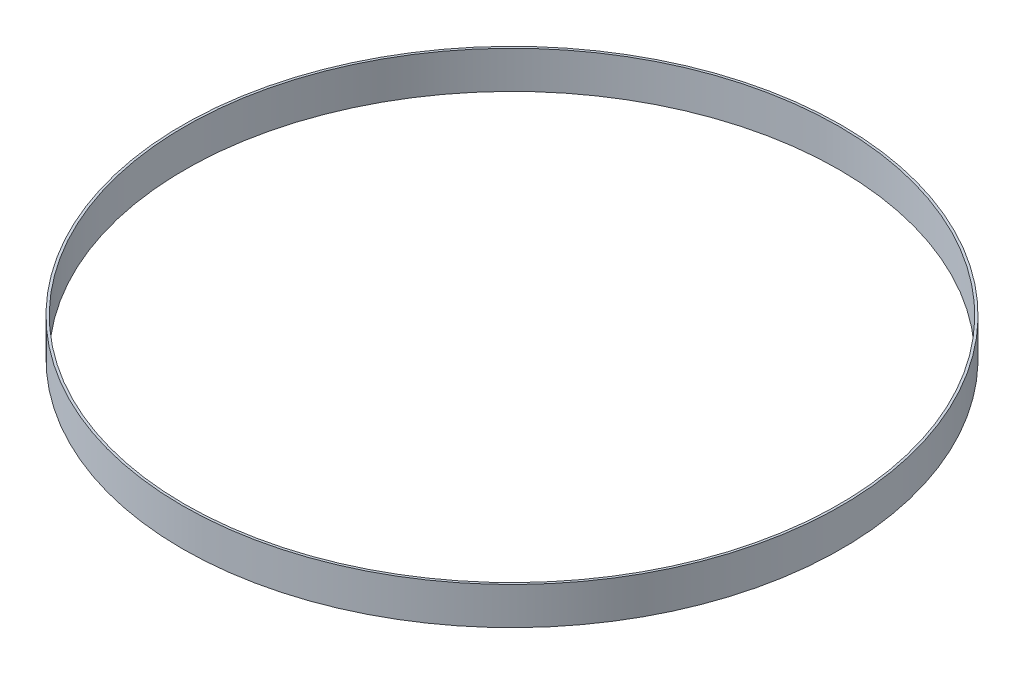
ISO-10303-21;
HEADER;
FILE_DESCRIPTION(('STEP AP214'),'2;1');
FILE_NAME('part.step','',(''),(''),'','','');
FILE_SCHEMA(('AUTOMOTIVE_DESIGN { 1 0 10303 214 1 1 1 1 }'));
ENDSEC;
DATA;
#1=APPLICATION_CONTEXT('core data for automotive mechanical design processes');
#2=APPLICATION_PROTOCOL_DEFINITION('international standard','automotive_design',2000,#1);
#3=PRODUCT_CONTEXT('',#1,'mechanical');
#4=PRODUCT('Part','Part','',(#3));
#5=PRODUCT_RELATED_PRODUCT_CATEGORY('part','',(#4));
#6=PRODUCT_DEFINITION_FORMATION('','',#4);
#7=PRODUCT_DEFINITION_CONTEXT('part definition',#1,'design');
#8=PRODUCT_DEFINITION('design','',#6,#7);
#9=PRODUCT_DEFINITION_SHAPE('','',#8);
#10=(LENGTH_UNIT() NAMED_UNIT(*) SI_UNIT(.MILLI.,.METRE.));
#11=(NAMED_UNIT(*) PLANE_ANGLE_UNIT() SI_UNIT($,.RADIAN.));
#12=(NAMED_UNIT(*) SI_UNIT($,.STERADIAN.) SOLID_ANGLE_UNIT());
#13=UNCERTAINTY_MEASURE_WITH_UNIT(LENGTH_MEASURE(1.E-05),#10,'distance_accuracy_value','');
#14=(GEOMETRIC_REPRESENTATION_CONTEXT(3) GLOBAL_UNCERTAINTY_ASSIGNED_CONTEXT((#13)) GLOBAL_UNIT_ASSIGNED_CONTEXT((#10,
#11,#12)) REPRESENTATION_CONTEXT('',''));
#15=CARTESIAN_POINT('',(0.,0.,0.));
#16=DIRECTION('',(0.,0.,1.));
#17=DIRECTION('',(1.,0.,0.));
#18=AXIS2_PLACEMENT_3D('',#15,#16,#17);
#19=CARTESIAN_POINT('',(0.,8.,0.));
#20=DIRECTION('',(0.,1.,0.));
#21=DIRECTION('',(0.,0.,1.));
#22=AXIS2_PLACEMENT_3D('',#19,#20,#21);
#23=PLANE('',#22);
#24=CARTESIAN_POINT('',(0.,8.,0.));
#25=DIRECTION('',(0.,1.,0.));
#26=DIRECTION('',(0.,0.,1.));
#27=AXIS2_PLACEMENT_3D('',#24,#25,#26);
#28=CIRCLE('',#27,70.5);
#29=CARTESIAN_POINT('',(0.,8.,70.5));
#30=VERTEX_POINT('',#29);
#31=EDGE_CURVE('E10',#30,#30,#28,.T.);
#32=ORIENTED_EDGE('',*,*,#31,.T.);
#33=EDGE_LOOP('',(#32));
#34=FACE_BOUND('',#33,.T.);
#35=CARTESIAN_POINT('',(0.,8.,0.));
#36=DIRECTION('',(0.,1.,0.));
#37=DIRECTION('',(0.,0.,1.));
#38=AXIS2_PLACEMENT_3D('',#35,#36,#37);
#39=CIRCLE('',#38,70.);
#40=CARTESIAN_POINT('',(0.,8.,70.));
#41=VERTEX_POINT('',#40);
#42=EDGE_CURVE('E56',#41,#41,#39,.T.);
#43=ORIENTED_EDGE('',*,*,#42,.F.);
#44=EDGE_LOOP('',(#43));
#45=FACE_BOUND('',#44,.T.);
#46=ADVANCED_FACE('F43',(#34,#45),#23,.T.);
#47=CARTESIAN_POINT('',(0.,0.,0.));
#48=DIRECTION('',(0.,1.,0.));
#49=DIRECTION('',(0.,0.,1.));
#50=AXIS2_PLACEMENT_3D('',#47,#48,#49);
#51=PLANE('',#50);
#52=CARTESIAN_POINT('',(0.,0.,0.));
#53=DIRECTION('',(0.,1.,0.));
#54=DIRECTION('',(0.,0.,1.));
#55=AXIS2_PLACEMENT_3D('',#52,#53,#54);
#56=CIRCLE('',#55,70.5);
#57=CARTESIAN_POINT('',(0.,0.,70.5));
#58=VERTEX_POINT('',#57);
#59=EDGE_CURVE('E47',#58,#58,#56,.T.);
#60=ORIENTED_EDGE('',*,*,#59,.F.);
#61=EDGE_LOOP('',(#60));
#62=FACE_BOUND('',#61,.T.);
#63=CARTESIAN_POINT('',(0.,0.,0.));
#64=DIRECTION('',(0.,1.,0.));
#65=DIRECTION('',(0.,0.,1.));
#66=AXIS2_PLACEMENT_3D('',#63,#64,#65);
#67=CIRCLE('',#66,70.);
#68=CARTESIAN_POINT('',(0.,0.,70.));
#69=VERTEX_POINT('',#68);
#70=EDGE_CURVE('E58',#69,#69,#67,.T.);
#71=ORIENTED_EDGE('',*,*,#70,.T.);
#72=EDGE_LOOP('',(#71));
#73=FACE_BOUND('',#72,.T.);
#74=ADVANCED_FACE('F70',(#62,#73),#51,.F.);
#75=CARTESIAN_POINT('',(0.,8.,0.));
#76=DIRECTION('',(0.,-1.,0.));
#77=DIRECTION('',(0.,0.,-1.));
#78=AXIS2_PLACEMENT_3D('',#75,#76,#77);
#79=CYLINDRICAL_SURFACE('',#78,70.5);
#80=ORIENTED_EDGE('',*,*,#31,.F.);
#81=EDGE_LOOP('',(#80));
#82=FACE_BOUND('',#81,.T.);
#83=ORIENTED_EDGE('',*,*,#59,.T.);
#84=EDGE_LOOP('',(#83));
#85=FACE_BOUND('',#84,.T.);
#86=ADVANCED_FACE('F45',(#82,#85),#79,.T.);
#87=CARTESIAN_POINT('',(0.,8.,0.));
#88=DIRECTION('',(0.,-1.,0.));
#89=DIRECTION('',(0.,0.,-1.));
#90=AXIS2_PLACEMENT_3D('',#87,#88,#89);
#91=CYLINDRICAL_SURFACE('',#90,70.);
#92=ORIENTED_EDGE('',*,*,#42,.T.);
#93=EDGE_LOOP('',(#92));
#94=FACE_BOUND('',#93,.T.);
#95=ORIENTED_EDGE('',*,*,#70,.F.);
#96=EDGE_LOOP('',(#95));
#97=FACE_BOUND('',#96,.T.);
#98=ADVANCED_FACE('F66',(#94,#97),#91,.F.);
#99=CLOSED_SHELL('',(#46,#74,#86,#98));
#100=MANIFOLD_SOLID_BREP('B2',#99);
#101=ADVANCED_BREP_SHAPE_REPRESENTATION('',(#18,#100),#14);
#102=SHAPE_DEFINITION_REPRESENTATION(#9,#101);
ENDSEC;
END-ISO-10303-21;
